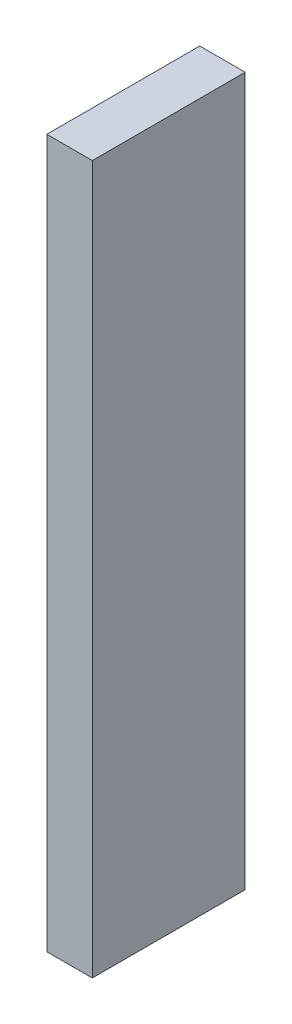
ISO-10303-21;
HEADER;
FILE_DESCRIPTION(('STEP AP214'),'2;1');
FILE_NAME('part.step','',(''),(''),'','','');
FILE_SCHEMA(('AUTOMOTIVE_DESIGN { 1 0 10303 214 1 1 1 1 }'));
ENDSEC;
DATA;
#1=APPLICATION_CONTEXT('core data for automotive mechanical design processes');
#2=APPLICATION_PROTOCOL_DEFINITION('international standard','automotive_design',2000,#1);
#3=PRODUCT_CONTEXT('',#1,'mechanical');
#4=PRODUCT('Part','Part','',(#3));
#5=PRODUCT_RELATED_PRODUCT_CATEGORY('part','',(#4));
#6=PRODUCT_DEFINITION_FORMATION('','',#4);
#7=PRODUCT_DEFINITION_CONTEXT('part definition',#1,'design');
#8=PRODUCT_DEFINITION('design','',#6,#7);
#9=PRODUCT_DEFINITION_SHAPE('','',#8);
#10=(LENGTH_UNIT() NAMED_UNIT(*) SI_UNIT(.MILLI.,.METRE.));
#11=(NAMED_UNIT(*) PLANE_ANGLE_UNIT() SI_UNIT($,.RADIAN.));
#12=(NAMED_UNIT(*) SI_UNIT($,.STERADIAN.) SOLID_ANGLE_UNIT());
#13=UNCERTAINTY_MEASURE_WITH_UNIT(LENGTH_MEASURE(1.E-05),#10,'distance_accuracy_value','');
#14=(GEOMETRIC_REPRESENTATION_CONTEXT(3) GLOBAL_UNCERTAINTY_ASSIGNED_CONTEXT((#13)) GLOBAL_UNIT_ASSIGNED_CONTEXT((#10,
#11,#12)) REPRESENTATION_CONTEXT('',''));
#15=CARTESIAN_POINT('',(0.,0.,0.));
#16=DIRECTION('',(0.,0.,1.));
#17=DIRECTION('',(1.,0.,0.));
#18=AXIS2_PLACEMENT_3D('',#15,#16,#17);
#19=CARTESIAN_POINT('',(130.275545229403,22.4180708263693,76.0720244776067));
#20=DIRECTION('',(-1.69244514382854E-09,0.,1.));
#21=DIRECTION('',(1.,0.,1.69244514382854E-09));
#22=AXIS2_PLACEMENT_3D('',#19,#20,#21);
#23=PLANE('',#22);
#24=DIRECTION('',(0.,-1.,0.));
#25=VECTOR('',#24,1.);
#26=CARTESIAN_POINT('',(131.258630326416,22.4180708263693,76.0720244792705));
#27=LINE('',#26,#25);
#28=CARTESIAN_POINT('',(131.258630326416,22.4180708263693,76.0720244792705));
#29=VERTEX_POINT('',#28);
#30=CARTESIAN_POINT('',(131.258630326416,7.11212965552236,76.0720244792705));
#31=VERTEX_POINT('',#30);
#32=EDGE_CURVE('E79',#29,#31,#27,.T.);
#33=ORIENTED_EDGE('',*,*,#32,.F.);
#34=DIRECTION('',(1.,0.,1.69244514382854E-09));
#35=VECTOR('',#34,1.);
#36=CARTESIAN_POINT('',(130.275545229403,22.4180708263693,76.0720244776067));
#37=LINE('',#36,#35);
#38=CARTESIAN_POINT('',(130.275545229403,22.4180708263693,76.0720244776067));
#39=VERTEX_POINT('',#38);
#40=EDGE_CURVE('E32',#39,#29,#37,.T.);
#41=ORIENTED_EDGE('',*,*,#40,.F.);
#42=DIRECTION('',(0.,-1.,0.));
#43=VECTOR('',#42,1.);
#44=CARTESIAN_POINT('',(130.275545229403,22.4180708263693,76.0720244776067));
#45=LINE('',#44,#43);
#46=CARTESIAN_POINT('',(130.275545229403,7.11212965552236,76.0720244776067));
#47=VERTEX_POINT('',#46);
#48=EDGE_CURVE('E71',#39,#47,#45,.T.);
#49=ORIENTED_EDGE('',*,*,#48,.T.);
#50=DIRECTION('',(1.,0.,1.69244514382854E-09));
#51=VECTOR('',#50,1.);
#52=CARTESIAN_POINT('',(130.275545229403,7.11212965552236,76.0720244776067));
#53=LINE('',#52,#51);
#54=EDGE_CURVE('E10',#47,#31,#53,.T.);
#55=ORIENTED_EDGE('',*,*,#54,.T.);
#56=EDGE_LOOP('',(#33,#41,#49,#55));
#57=FACE_BOUND('',#56,.T.);
#58=ADVANCED_FACE('F16',(#57),#23,.T.);
#59=CARTESIAN_POINT('',(130.275545229403,7.11212965552236,76.0720244776067));
#60=DIRECTION('',(0.,-1.,0.));
#61=DIRECTION('',(0.,0.,-1.));
#62=AXIS2_PLACEMENT_3D('',#59,#60,#61);
#63=PLANE('',#62);
#64=DIRECTION('',(1.69244514382854E-09,0.,-1.));
#65=VECTOR('',#64,1.);
#66=CARTESIAN_POINT('',(131.258630326416,7.11212965552236,76.0720244792705));
#67=LINE('',#66,#65);
#68=CARTESIAN_POINT('',(131.258630332012,7.11212965552235,72.7660833084218));
#69=VERTEX_POINT('',#68);
#70=EDGE_CURVE('E82',#31,#69,#67,.T.);
#71=ORIENTED_EDGE('',*,*,#70,.F.);
#72=ORIENTED_EDGE('',*,*,#54,.F.);
#73=DIRECTION('',(1.69244514382854E-09,0.,-1.));
#74=VECTOR('',#73,1.);
#75=CARTESIAN_POINT('',(130.275545229403,7.11212965552236,76.0720244776067));
#76=LINE('',#75,#74);
#77=CARTESIAN_POINT('',(130.275545234999,7.11212965552235,72.766083306758));
#78=VERTEX_POINT('',#77);
#79=EDGE_CURVE('E67',#47,#78,#76,.T.);
#80=ORIENTED_EDGE('',*,*,#79,.T.);
#81=DIRECTION('',(1.,0.,1.69244514382854E-09));
#82=VECTOR('',#81,1.);
#83=CARTESIAN_POINT('',(130.275545234999,7.11212965552235,72.766083306758));
#84=LINE('',#83,#82);
#85=EDGE_CURVE('E24',#78,#69,#84,.T.);
#86=ORIENTED_EDGE('',*,*,#85,.T.);
#87=EDGE_LOOP('',(#71,#72,#80,#86));
#88=FACE_BOUND('',#87,.T.);
#89=ADVANCED_FACE('F68',(#88),#63,.T.);
#90=CARTESIAN_POINT('',(130.275545234999,7.11212965552235,72.766083306758));
#91=DIRECTION('',(1.69244514382854E-09,0.,-1.));
#92=DIRECTION('',(-1.,0.,-1.69244514382854E-09));
#93=AXIS2_PLACEMENT_3D('',#90,#91,#92);
#94=PLANE('',#93);
#95=DIRECTION('',(0.,1.,0.));
#96=VECTOR('',#95,1.);
#97=CARTESIAN_POINT('',(131.258630332012,7.11212965552235,72.7660833084218));
#98=LINE('',#97,#96);
#99=CARTESIAN_POINT('',(131.258630332012,22.418070826371,72.7660832999612));
#100=VERTEX_POINT('',#99);
#101=EDGE_CURVE('E65',#69,#100,#98,.T.);
#102=ORIENTED_EDGE('',*,*,#101,.F.);
#103=ORIENTED_EDGE('',*,*,#85,.F.);
#104=DIRECTION('',(0.,1.,0.));
#105=VECTOR('',#104,1.);
#106=CARTESIAN_POINT('',(130.275545234999,7.11212965552235,72.766083306758));
#107=LINE('',#106,#105);
#108=CARTESIAN_POINT('',(130.275545234999,22.418070826371,72.7660832982974));
#109=VERTEX_POINT('',#108);
#110=EDGE_CURVE('E62',#78,#109,#107,.T.);
#111=ORIENTED_EDGE('',*,*,#110,.T.);
#112=DIRECTION('',(1.,0.,1.69244514382854E-09));
#113=VECTOR('',#112,1.);
#114=CARTESIAN_POINT('',(130.275545234999,22.418070826371,72.7660832982974));
#115=LINE('',#114,#113);
#116=EDGE_CURVE('E48',#109,#100,#115,.T.);
#117=ORIENTED_EDGE('',*,*,#116,.T.);
#118=EDGE_LOOP('',(#102,#103,#111,#117));
#119=FACE_BOUND('',#118,.T.);
#120=ADVANCED_FACE('F60',(#119),#94,.T.);
#121=CARTESIAN_POINT('',(130.275545234999,22.418070826371,72.7660832982974));
#122=DIRECTION('',(0.,1.,0.));
#123=DIRECTION('',(-1.,0.,0.));
#124=AXIS2_PLACEMENT_3D('',#121,#122,#123);
#125=PLANE('',#124);
#126=DIRECTION('',(-1.69244514382854E-09,0.,1.));
#127=VECTOR('',#126,1.);
#128=CARTESIAN_POINT('',(131.258630332012,22.418070826371,72.7660832999612));
#129=LINE('',#128,#127);
#130=EDGE_CURVE('E85',#100,#29,#129,.T.);
#131=ORIENTED_EDGE('',*,*,#130,.F.);
#132=ORIENTED_EDGE('',*,*,#116,.F.);
#133=DIRECTION('',(-1.69244514382854E-09,0.,1.));
#134=VECTOR('',#133,1.);
#135=CARTESIAN_POINT('',(130.275545234999,22.418070826371,72.7660832982974));
#136=LINE('',#135,#134);
#137=EDGE_CURVE('E74',#109,#39,#136,.T.);
#138=ORIENTED_EDGE('',*,*,#137,.T.);
#139=ORIENTED_EDGE('',*,*,#40,.T.);
#140=EDGE_LOOP('',(#131,#132,#138,#139));
#141=FACE_BOUND('',#140,.T.);
#142=ADVANCED_FACE('F96',(#141),#125,.T.);
#143=CARTESIAN_POINT('',(130.275545201028,17.2651002409467,92.8378607087388));
#144=DIRECTION('',(1.,0.,1.69244514382854E-09));
#145=DIRECTION('',(0.,1.,0.));
#146=AXIS2_PLACEMENT_3D('',#143,#144,#145);
#147=PLANE('',#146);
#148=ORIENTED_EDGE('',*,*,#48,.F.);
#149=ORIENTED_EDGE('',*,*,#137,.F.);
#150=ORIENTED_EDGE('',*,*,#110,.F.);
#151=ORIENTED_EDGE('',*,*,#79,.F.);
#152=EDGE_LOOP('',(#148,#149,#150,#151));
#153=FACE_BOUND('',#152,.T.);
#154=ADVANCED_FACE('F73',(#153),#147,.F.);
#155=CARTESIAN_POINT('',(131.258630298041,17.2651002409467,92.8378607104026));
#156=DIRECTION('',(1.,0.,1.69244514382854E-09));
#157=DIRECTION('',(0.,1.,0.));
#158=AXIS2_PLACEMENT_3D('',#155,#156,#157);
#159=PLANE('',#158);
#160=ORIENTED_EDGE('',*,*,#32,.T.);
#161=ORIENTED_EDGE('',*,*,#70,.T.);
#162=ORIENTED_EDGE('',*,*,#101,.T.);
#163=ORIENTED_EDGE('',*,*,#130,.T.);
#164=EDGE_LOOP('',(#160,#161,#162,#163));
#165=FACE_BOUND('',#164,.T.);
#166=ADVANCED_FACE('F89',(#165),#159,.T.);
#167=CLOSED_SHELL('',(#58,#89,#120,#142,#154,#166));
#168=MANIFOLD_SOLID_BREP('B1',#167);
#169=ADVANCED_BREP_SHAPE_REPRESENTATION('',(#18,#168),#14);
#170=SHAPE_DEFINITION_REPRESENTATION(#9,#169);
ENDSEC;
END-ISO-10303-21;
